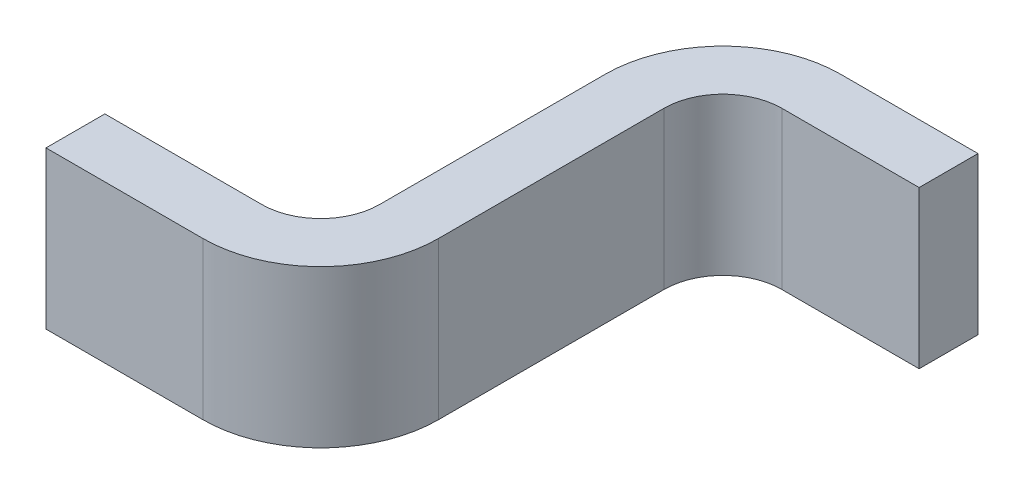
ISO-10303-21;
HEADER;
FILE_DESCRIPTION(('STEP AP214'),'2;1');
FILE_NAME('part.step','',(''),(''),'','','');
FILE_SCHEMA(('AUTOMOTIVE_DESIGN { 1 0 10303 214 1 1 1 1 }'));
ENDSEC;
DATA;
#1=APPLICATION_CONTEXT('core data for automotive mechanical design processes');
#2=APPLICATION_PROTOCOL_DEFINITION('international standard','automotive_design',2000,#1);
#3=PRODUCT_CONTEXT('',#1,'mechanical');
#4=PRODUCT('Part','Part','',(#3));
#5=PRODUCT_RELATED_PRODUCT_CATEGORY('part','',(#4));
#6=PRODUCT_DEFINITION_FORMATION('','',#4);
#7=PRODUCT_DEFINITION_CONTEXT('part definition',#1,'design');
#8=PRODUCT_DEFINITION('design','',#6,#7);
#9=PRODUCT_DEFINITION_SHAPE('','',#8);
#10=(LENGTH_UNIT() NAMED_UNIT(*) SI_UNIT(.MILLI.,.METRE.));
#11=(NAMED_UNIT(*) PLANE_ANGLE_UNIT() SI_UNIT($,.RADIAN.));
#12=(NAMED_UNIT(*) SI_UNIT($,.STERADIAN.) SOLID_ANGLE_UNIT());
#13=UNCERTAINTY_MEASURE_WITH_UNIT(LENGTH_MEASURE(1.E-05),#10,'distance_accuracy_value','');
#14=(GEOMETRIC_REPRESENTATION_CONTEXT(3) GLOBAL_UNCERTAINTY_ASSIGNED_CONTEXT((#13)) GLOBAL_UNIT_ASSIGNED_CONTEXT((#10,
#11,#12)) REPRESENTATION_CONTEXT('',''));
#15=CARTESIAN_POINT('',(0.,0.,0.));
#16=DIRECTION('',(0.,0.,1.));
#17=DIRECTION('',(1.,0.,0.));
#18=AXIS2_PLACEMENT_3D('',#15,#16,#17);
#19=CARTESIAN_POINT('',(3.15,1.47,0.));
#20=DIRECTION('',(0.,1.,0.));
#21=DIRECTION('',(1.,0.,0.));
#22=AXIS2_PLACEMENT_3D('',#19,#20,#21);
#23=PLANE('',#22);
#24=DIRECTION('',(-1.,0.,0.));
#25=VECTOR('',#24,1.);
#26=CARTESIAN_POINT('',(-2.475,1.47,0.));
#27=LINE('',#26,#25);
#28=CARTESIAN_POINT('',(3.4,1.47,0.));
#29=VERTEX_POINT('',#28);
#30=CARTESIAN_POINT('',(3.05,1.47,0.));
#31=VERTEX_POINT('',#30);
#32=EDGE_CURVE('E11',#29,#31,#27,.T.);
#33=ORIENTED_EDGE('',*,*,#32,.T.);
#34=CARTESIAN_POINT('',(3.05,1.47,0.3));
#35=DIRECTION('',(0.,-1.,0.));
#36=DIRECTION('',(0.,0.,-1.));
#37=AXIS2_PLACEMENT_3D('',#34,#35,#36);
#38=CIRCLE('',#37,0.3);
#39=CARTESIAN_POINT('',(2.75,1.47,0.3));
#40=VERTEX_POINT('',#39);
#41=EDGE_CURVE('E182',#40,#31,#38,.T.);
#42=ORIENTED_EDGE('',*,*,#41,.F.);
#43=DIRECTION('',(0.,0.,-1.));
#44=VECTOR('',#43,1.);
#45=CARTESIAN_POINT('',(2.75,1.47,1.175));
#46=LINE('',#45,#44);
#47=CARTESIAN_POINT('',(2.75,1.47,0.875));
#48=VERTEX_POINT('',#47);
#49=EDGE_CURVE('E237',#48,#40,#46,.T.);
#50=ORIENTED_EDGE('',*,*,#49,.F.);
#51=CARTESIAN_POINT('',(2.6,1.47,0.875));
#52=DIRECTION('',(0.,-1.,0.));
#53=DIRECTION('',(0.,0.,-1.));
#54=AXIS2_PLACEMENT_3D('',#51,#52,#53);
#55=CIRCLE('',#54,0.15);
#56=CARTESIAN_POINT('',(2.6,1.47,1.025));
#57=VERTEX_POINT('',#56);
#58=EDGE_CURVE('E232',#48,#57,#55,.T.);
#59=ORIENTED_EDGE('',*,*,#58,.T.);
#60=DIRECTION('',(-1.,0.,0.));
#61=VECTOR('',#60,1.);
#62=CARTESIAN_POINT('',(0.,1.47,1.025));
#63=LINE('',#62,#61);
#64=CARTESIAN_POINT('',(2.2,1.47,1.025));
#65=VERTEX_POINT('',#64);
#66=EDGE_CURVE('E191',#57,#65,#63,.T.);
#67=ORIENTED_EDGE('',*,*,#66,.T.);
#68=DIRECTION('',(0.,0.,-1.));
#69=VECTOR('',#68,1.);
#70=CARTESIAN_POINT('',(2.2,1.47,1.1));
#71=LINE('',#70,#69);
#72=CARTESIAN_POINT('',(2.2,1.47,1.175));
#73=VERTEX_POINT('',#72);
#74=EDGE_CURVE('E190',#73,#65,#71,.T.);
#75=ORIENTED_EDGE('',*,*,#74,.F.);
#76=DIRECTION('',(-1.,0.,0.));
#77=VECTOR('',#76,1.);
#78=CARTESIAN_POINT('',(-2.475,1.47,1.175));
#79=LINE('',#78,#77);
#80=CARTESIAN_POINT('',(2.6,1.47,1.175));
#81=VERTEX_POINT('',#80);
#82=EDGE_CURVE('E79',#81,#73,#79,.T.);
#83=ORIENTED_EDGE('',*,*,#82,.F.);
#84=CARTESIAN_POINT('',(2.6,1.47,0.875));
#85=DIRECTION('',(0.,-1.,0.));
#86=DIRECTION('',(0.,0.,-1.));
#87=AXIS2_PLACEMENT_3D('',#84,#85,#86);
#88=CIRCLE('',#87,0.3);
#89=CARTESIAN_POINT('',(2.9,1.47,0.875));
#90=VERTEX_POINT('',#89);
#91=EDGE_CURVE('E65',#90,#81,#88,.T.);
#92=ORIENTED_EDGE('',*,*,#91,.F.);
#93=DIRECTION('',(0.,0.,1.));
#94=VECTOR('',#93,1.);
#95=CARTESIAN_POINT('',(2.9,1.47,1.175));
#96=LINE('',#95,#94);
#97=CARTESIAN_POINT('',(2.9,1.47,0.3));
#98=VERTEX_POINT('',#97);
#99=EDGE_CURVE('E161',#98,#90,#96,.T.);
#100=ORIENTED_EDGE('',*,*,#99,.F.);
#101=CARTESIAN_POINT('',(3.05,1.47,0.3));
#102=DIRECTION('',(0.,-1.,0.));
#103=DIRECTION('',(0.,0.,-1.));
#104=AXIS2_PLACEMENT_3D('',#101,#102,#103);
#105=CIRCLE('',#104,0.15);
#106=CARTESIAN_POINT('',(3.05,1.47,0.15));
#107=VERTEX_POINT('',#106);
#108=EDGE_CURVE('E151',#98,#107,#105,.T.);
#109=ORIENTED_EDGE('',*,*,#108,.T.);
#110=DIRECTION('',(-1.,0.,0.));
#111=VECTOR('',#110,1.);
#112=CARTESIAN_POINT('',(0.,1.47,0.15));
#113=LINE('',#112,#111);
#114=CARTESIAN_POINT('',(3.4,1.47,0.15));
#115=VERTEX_POINT('',#114);
#116=EDGE_CURVE('E20',#115,#107,#113,.T.);
#117=ORIENTED_EDGE('',*,*,#116,.F.);
#118=DIRECTION('',(0.,0.,1.));
#119=VECTOR('',#118,1.);
#120=CARTESIAN_POINT('',(3.4,1.47,0.));
#121=LINE('',#120,#119);
#122=EDGE_CURVE('E26',#29,#115,#121,.T.);
#123=ORIENTED_EDGE('',*,*,#122,.F.);
#124=EDGE_LOOP('',(#33,#42,#50,#59,#67,#75,#83,#92,#100,#109,#117,#123));
#125=FACE_BOUND('',#124,.T.);
#126=ADVANCED_FACE('F16',(#125),#23,.T.);
#127=CARTESIAN_POINT('',(-2.475,1.27,0.));
#128=DIRECTION('',(0.,0.,1.));
#129=DIRECTION('',(1.,0.,0.));
#130=AXIS2_PLACEMENT_3D('',#127,#128,#129);
#131=PLANE('',#130);
#132=ORIENTED_EDGE('',*,*,#32,.F.);
#133=DIRECTION('',(0.,1.,0.));
#134=VECTOR('',#133,1.);
#135=CARTESIAN_POINT('',(3.4,1.27,0.));
#136=LINE('',#135,#134);
#137=CARTESIAN_POINT('',(3.4,1.07,0.));
#138=VERTEX_POINT('',#137);
#139=EDGE_CURVE('E223',#138,#29,#136,.T.);
#140=ORIENTED_EDGE('',*,*,#139,.F.);
#141=DIRECTION('',(1.,0.,0.));
#142=VECTOR('',#141,1.);
#143=CARTESIAN_POINT('',(2.825,1.07,0.));
#144=LINE('',#143,#142);
#145=CARTESIAN_POINT('',(3.05,1.07,0.));
#146=VERTEX_POINT('',#145);
#147=EDGE_CURVE('E197',#146,#138,#144,.T.);
#148=ORIENTED_EDGE('',*,*,#147,.F.);
#149=DIRECTION('',(0.,-1.,0.));
#150=VECTOR('',#149,1.);
#151=CARTESIAN_POINT('',(3.05,1.27,0.));
#152=LINE('',#151,#150);
#153=EDGE_CURVE('E179',#31,#146,#152,.T.);
#154=ORIENTED_EDGE('',*,*,#153,.F.);
#155=EDGE_LOOP('',(#132,#140,#148,#154));
#156=FACE_BOUND('',#155,.T.);
#157=ADVANCED_FACE('F286',(#156),#131,.F.);
#158=CARTESIAN_POINT('',(3.4,1.27,0.));
#159=DIRECTION('',(1.,0.,0.));
#160=DIRECTION('',(0.,1.,0.));
#161=AXIS2_PLACEMENT_3D('',#158,#159,#160);
#162=PLANE('',#161);
#163=ORIENTED_EDGE('',*,*,#139,.T.);
#164=ORIENTED_EDGE('',*,*,#122,.T.);
#165=DIRECTION('',(0.,1.,0.));
#166=VECTOR('',#165,1.);
#167=CARTESIAN_POINT('',(3.4,0.,0.15));
#168=LINE('',#167,#166);
#169=CARTESIAN_POINT('',(3.4,1.07,0.15));
#170=VERTEX_POINT('',#169);
#171=EDGE_CURVE('E201',#170,#115,#168,.T.);
#172=ORIENTED_EDGE('',*,*,#171,.F.);
#173=DIRECTION('',(0.,0.,1.));
#174=VECTOR('',#173,1.);
#175=CARTESIAN_POINT('',(3.4,1.07,1.175));
#176=LINE('',#175,#174);
#177=EDGE_CURVE('E205',#138,#170,#176,.T.);
#178=ORIENTED_EDGE('',*,*,#177,.F.);
#179=EDGE_LOOP('',(#163,#164,#172,#178));
#180=FACE_BOUND('',#179,.T.);
#181=ADVANCED_FACE('F287',(#180),#162,.T.);
#182=CARTESIAN_POINT('',(0.,0.,0.15));
#183=DIRECTION('',(0.,0.,1.));
#184=DIRECTION('',(1.,0.,0.));
#185=AXIS2_PLACEMENT_3D('',#182,#183,#184);
#186=PLANE('',#185);
#187=ORIENTED_EDGE('',*,*,#171,.T.);
#188=ORIENTED_EDGE('',*,*,#116,.T.);
#189=DIRECTION('',(0.,-1.,0.));
#190=VECTOR('',#189,1.);
#191=CARTESIAN_POINT('',(3.05,0.635,0.15));
#192=LINE('',#191,#190);
#193=CARTESIAN_POINT('',(3.05,1.07,0.15));
#194=VERTEX_POINT('',#193);
#195=EDGE_CURVE('E158',#107,#194,#192,.T.);
#196=ORIENTED_EDGE('',*,*,#195,.T.);
#197=DIRECTION('',(-1.,0.,0.));
#198=VECTOR('',#197,1.);
#199=CARTESIAN_POINT('',(2.825,1.07,0.15));
#200=LINE('',#199,#198);
#201=EDGE_CURVE('E185',#170,#194,#200,.T.);
#202=ORIENTED_EDGE('',*,*,#201,.F.);
#203=EDGE_LOOP('',(#187,#188,#196,#202));
#204=FACE_BOUND('',#203,.T.);
#205=ADVANCED_FACE('F290',(#204),#186,.T.);
#206=CARTESIAN_POINT('',(3.05,0.635,0.3));
#207=DIRECTION('',(0.,-1.,0.));
#208=DIRECTION('',(0.,0.,-1.));
#209=AXIS2_PLACEMENT_3D('',#206,#207,#208);
#210=CYLINDRICAL_SURFACE('',#209,0.15);
#211=ORIENTED_EDGE('',*,*,#108,.F.);
#212=DIRECTION('',(0.,1.,0.));
#213=VECTOR('',#212,1.);
#214=CARTESIAN_POINT('',(2.9,1.27,0.3));
#215=LINE('',#214,#213);
#216=CARTESIAN_POINT('',(2.9,1.07,0.3));
#217=VERTEX_POINT('',#216);
#218=EDGE_CURVE('E156',#217,#98,#215,.T.);
#219=ORIENTED_EDGE('',*,*,#218,.F.);
#220=CARTESIAN_POINT('',(3.05,1.07,0.3));
#221=DIRECTION('',(0.,1.,0.));
#222=DIRECTION('',(0.,0.,-1.));
#223=AXIS2_PLACEMENT_3D('',#220,#221,#222);
#224=CIRCLE('',#223,0.15);
#225=EDGE_CURVE('E183',#194,#217,#224,.T.);
#226=ORIENTED_EDGE('',*,*,#225,.F.);
#227=ORIENTED_EDGE('',*,*,#195,.F.);
#228=EDGE_LOOP('',(#211,#219,#226,#227));
#229=FACE_BOUND('',#228,.T.);
#230=ADVANCED_FACE('F153',(#229),#210,.F.);
#231=CARTESIAN_POINT('',(2.9,1.27,1.175));
#232=DIRECTION('',(1.,0.,0.));
#233=DIRECTION('',(0.,1.,0.));
#234=AXIS2_PLACEMENT_3D('',#231,#232,#233);
#235=PLANE('',#234);
#236=DIRECTION('',(0.,1.,0.));
#237=VECTOR('',#236,1.);
#238=CARTESIAN_POINT('',(2.9,1.27,0.875));
#239=LINE('',#238,#237);
#240=CARTESIAN_POINT('',(2.9,1.07,0.875));
#241=VERTEX_POINT('',#240);
#242=EDGE_CURVE('E176',#241,#90,#239,.T.);
#243=ORIENTED_EDGE('',*,*,#242,.F.);
#244=DIRECTION('',(0.,0.,1.));
#245=VECTOR('',#244,1.);
#246=CARTESIAN_POINT('',(2.9,1.07,1.175));
#247=LINE('',#246,#245);
#248=EDGE_CURVE('E168',#217,#241,#247,.T.);
#249=ORIENTED_EDGE('',*,*,#248,.F.);
#250=ORIENTED_EDGE('',*,*,#218,.T.);
#251=ORIENTED_EDGE('',*,*,#99,.T.);
#252=EDGE_LOOP('',(#243,#249,#250,#251));
#253=FACE_BOUND('',#252,.T.);
#254=ADVANCED_FACE('F166',(#253),#235,.T.);
#255=CARTESIAN_POINT('',(2.6,1.27,0.875));
#256=DIRECTION('',(0.,-1.,0.));
#257=DIRECTION('',(0.,0.,-1.));
#258=AXIS2_PLACEMENT_3D('',#255,#256,#257);
#259=CYLINDRICAL_SURFACE('',#258,0.3);
#260=DIRECTION('',(0.,1.,0.));
#261=VECTOR('',#260,1.);
#262=CARTESIAN_POINT('',(2.6,1.27,1.175));
#263=LINE('',#262,#261);
#264=CARTESIAN_POINT('',(2.6,1.07,1.175));
#265=VERTEX_POINT('',#264);
#266=EDGE_CURVE('E227',#265,#81,#263,.T.);
#267=ORIENTED_EDGE('',*,*,#266,.F.);
#268=CARTESIAN_POINT('',(2.6,1.07,0.875));
#269=DIRECTION('',(0.,-1.,0.));
#270=DIRECTION('',(0.,0.,-1.));
#271=AXIS2_PLACEMENT_3D('',#268,#269,#270);
#272=CIRCLE('',#271,0.3);
#273=EDGE_CURVE('E243',#241,#265,#272,.T.);
#274=ORIENTED_EDGE('',*,*,#273,.F.);
#275=ORIENTED_EDGE('',*,*,#242,.T.);
#276=ORIENTED_EDGE('',*,*,#91,.T.);
#277=EDGE_LOOP('',(#267,#274,#275,#276));
#278=FACE_BOUND('',#277,.T.);
#279=ADVANCED_FACE('F293',(#278),#259,.T.);
#280=CARTESIAN_POINT('',(-2.475,1.27,1.175));
#281=DIRECTION('',(0.,0.,1.));
#282=DIRECTION('',(1.,0.,0.));
#283=AXIS2_PLACEMENT_3D('',#280,#281,#282);
#284=PLANE('',#283);
#285=DIRECTION('',(0.,1.,0.));
#286=VECTOR('',#285,1.);
#287=CARTESIAN_POINT('',(2.2,1.27,1.175));
#288=LINE('',#287,#286);
#289=CARTESIAN_POINT('',(2.2,1.07,1.175));
#290=VERTEX_POINT('',#289);
#291=EDGE_CURVE('E187',#290,#73,#288,.T.);
#292=ORIENTED_EDGE('',*,*,#291,.F.);
#293=DIRECTION('',(-1.,0.,0.));
#294=VECTOR('',#293,1.);
#295=CARTESIAN_POINT('',(2.825,1.07,1.175));
#296=LINE('',#295,#294);
#297=EDGE_CURVE('E214',#265,#290,#296,.T.);
#298=ORIENTED_EDGE('',*,*,#297,.F.);
#299=ORIENTED_EDGE('',*,*,#266,.T.);
#300=ORIENTED_EDGE('',*,*,#82,.T.);
#301=EDGE_LOOP('',(#292,#298,#299,#300));
#302=FACE_BOUND('',#301,.T.);
#303=ADVANCED_FACE('F294',(#302),#284,.T.);
#304=CARTESIAN_POINT('',(2.2,1.27,1.1));
#305=DIRECTION('',(-1.,0.,0.));
#306=DIRECTION('',(0.,0.,1.));
#307=AXIS2_PLACEMENT_3D('',#304,#305,#306);
#308=PLANE('',#307);
#309=ORIENTED_EDGE('',*,*,#291,.T.);
#310=ORIENTED_EDGE('',*,*,#74,.T.);
#311=DIRECTION('',(0.,-1.,0.));
#312=VECTOR('',#311,1.);
#313=CARTESIAN_POINT('',(2.2,0.,1.025));
#314=LINE('',#313,#312);
#315=CARTESIAN_POINT('',(2.2,1.07,1.025));
#316=VERTEX_POINT('',#315);
#317=EDGE_CURVE('E258',#65,#316,#314,.T.);
#318=ORIENTED_EDGE('',*,*,#317,.T.);
#319=DIRECTION('',(0.,0.,-1.));
#320=VECTOR('',#319,1.);
#321=CARTESIAN_POINT('',(2.2,1.07,1.175));
#322=LINE('',#321,#320);
#323=EDGE_CURVE('E209',#290,#316,#322,.T.);
#324=ORIENTED_EDGE('',*,*,#323,.F.);
#325=EDGE_LOOP('',(#309,#310,#318,#324));
#326=FACE_BOUND('',#325,.T.);
#327=ADVANCED_FACE('F297',(#326),#308,.T.);
#328=CARTESIAN_POINT('',(0.,0.,1.025));
#329=DIRECTION('',(0.,0.,1.));
#330=DIRECTION('',(1.,0.,0.));
#331=AXIS2_PLACEMENT_3D('',#328,#329,#330);
#332=PLANE('',#331);
#333=DIRECTION('',(1.,0.,0.));
#334=VECTOR('',#333,1.);
#335=CARTESIAN_POINT('',(2.825,1.07,1.025));
#336=LINE('',#335,#334);
#337=CARTESIAN_POINT('',(2.6,1.07,1.025));
#338=VERTEX_POINT('',#337);
#339=EDGE_CURVE('E213',#316,#338,#336,.T.);
#340=ORIENTED_EDGE('',*,*,#339,.F.);
#341=ORIENTED_EDGE('',*,*,#317,.F.);
#342=ORIENTED_EDGE('',*,*,#66,.F.);
#343=DIRECTION('',(0.,-1.,0.));
#344=VECTOR('',#343,1.);
#345=CARTESIAN_POINT('',(2.6,0.635,1.025));
#346=LINE('',#345,#344);
#347=EDGE_CURVE('E236',#57,#338,#346,.T.);
#348=ORIENTED_EDGE('',*,*,#347,.T.);
#349=EDGE_LOOP('',(#340,#341,#342,#348));
#350=FACE_BOUND('',#349,.T.);
#351=ADVANCED_FACE('F303',(#350),#332,.F.);
#352=CARTESIAN_POINT('',(2.6,0.635,0.875));
#353=DIRECTION('',(0.,-1.,0.));
#354=DIRECTION('',(0.,0.,-1.));
#355=AXIS2_PLACEMENT_3D('',#352,#353,#354);
#356=CYLINDRICAL_SURFACE('',#355,0.15);
#357=ORIENTED_EDGE('',*,*,#58,.F.);
#358=DIRECTION('',(0.,1.,0.));
#359=VECTOR('',#358,1.);
#360=CARTESIAN_POINT('',(2.75,1.27,0.875));
#361=LINE('',#360,#359);
#362=CARTESIAN_POINT('',(2.75,1.07,0.875));
#363=VERTEX_POINT('',#362);
#364=EDGE_CURVE('E181',#363,#48,#361,.T.);
#365=ORIENTED_EDGE('',*,*,#364,.F.);
#366=CARTESIAN_POINT('',(2.6,1.07,0.875));
#367=DIRECTION('',(0.,1.,0.));
#368=DIRECTION('',(0.,0.,-1.));
#369=AXIS2_PLACEMENT_3D('',#366,#367,#368);
#370=CIRCLE('',#369,0.15);
#371=EDGE_CURVE('E215',#338,#363,#370,.T.);
#372=ORIENTED_EDGE('',*,*,#371,.F.);
#373=ORIENTED_EDGE('',*,*,#347,.F.);
#374=EDGE_LOOP('',(#357,#365,#372,#373));
#375=FACE_BOUND('',#374,.T.);
#376=ADVANCED_FACE('F306',(#375),#356,.F.);
#377=CARTESIAN_POINT('',(2.75,1.27,1.175));
#378=DIRECTION('',(-1.,0.,0.));
#379=DIRECTION('',(0.,0.,1.));
#380=AXIS2_PLACEMENT_3D('',#377,#378,#379);
#381=PLANE('',#380);
#382=ORIENTED_EDGE('',*,*,#364,.T.);
#383=ORIENTED_EDGE('',*,*,#49,.T.);
#384=DIRECTION('',(0.,1.,0.));
#385=VECTOR('',#384,1.);
#386=CARTESIAN_POINT('',(2.75,1.27,0.3));
#387=LINE('',#386,#385);
#388=CARTESIAN_POINT('',(2.75,1.07,0.3));
#389=VERTEX_POINT('',#388);
#390=EDGE_CURVE('E219',#389,#40,#387,.T.);
#391=ORIENTED_EDGE('',*,*,#390,.F.);
#392=DIRECTION('',(0.,0.,-1.));
#393=VECTOR('',#392,1.);
#394=CARTESIAN_POINT('',(2.75,1.07,1.175));
#395=LINE('',#394,#393);
#396=EDGE_CURVE('E198',#363,#389,#395,.T.);
#397=ORIENTED_EDGE('',*,*,#396,.F.);
#398=EDGE_LOOP('',(#382,#383,#391,#397));
#399=FACE_BOUND('',#398,.T.);
#400=ADVANCED_FACE('F18',(#399),#381,.T.);
#401=CARTESIAN_POINT('',(3.05,1.27,0.3));
#402=DIRECTION('',(0.,-1.,0.));
#403=DIRECTION('',(0.,0.,-1.));
#404=AXIS2_PLACEMENT_3D('',#401,#402,#403);
#405=CYLINDRICAL_SURFACE('',#404,0.3);
#406=ORIENTED_EDGE('',*,*,#390,.T.);
#407=ORIENTED_EDGE('',*,*,#41,.T.);
#408=ORIENTED_EDGE('',*,*,#153,.T.);
#409=CARTESIAN_POINT('',(3.05,1.07,0.3));
#410=DIRECTION('',(0.,-1.,0.));
#411=DIRECTION('',(0.,0.,-1.));
#412=AXIS2_PLACEMENT_3D('',#409,#410,#411);
#413=CIRCLE('',#412,0.3);
#414=EDGE_CURVE('E193',#389,#146,#413,.T.);
#415=ORIENTED_EDGE('',*,*,#414,.F.);
#416=EDGE_LOOP('',(#406,#407,#408,#415));
#417=FACE_BOUND('',#416,.T.);
#418=ADVANCED_FACE('F311',(#417),#405,.T.);
#419=CARTESIAN_POINT('',(2.825,1.07,1.175));
#420=DIRECTION('',(0.,-1.,0.));
#421=DIRECTION('',(0.,0.,-1.));
#422=AXIS2_PLACEMENT_3D('',#419,#420,#421);
#423=PLANE('',#422);
#424=ORIENTED_EDGE('',*,*,#396,.T.);
#425=ORIENTED_EDGE('',*,*,#414,.T.);
#426=ORIENTED_EDGE('',*,*,#147,.T.);
#427=ORIENTED_EDGE('',*,*,#177,.T.);
#428=ORIENTED_EDGE('',*,*,#201,.T.);
#429=ORIENTED_EDGE('',*,*,#225,.T.);
#430=ORIENTED_EDGE('',*,*,#248,.T.);
#431=ORIENTED_EDGE('',*,*,#273,.T.);
#432=ORIENTED_EDGE('',*,*,#297,.T.);
#433=ORIENTED_EDGE('',*,*,#323,.T.);
#434=ORIENTED_EDGE('',*,*,#339,.T.);
#435=ORIENTED_EDGE('',*,*,#371,.T.);
#436=EDGE_LOOP('',(#424,#425,#426,#427,#428,#429,#430,#431,#432,#433,#434,#435));
#437=FACE_BOUND('',#436,.T.);
#438=ADVANCED_FACE('F283',(#437),#423,.T.);
#439=CLOSED_SHELL('',(#126,#157,#181,#205,#230,#254,#279,#303,#327,#351,#376,#400,#418,#438));
#440=MANIFOLD_SOLID_BREP('B1',#439);
#441=ADVANCED_BREP_SHAPE_REPRESENTATION('',(#18,#440),#14);
#442=SHAPE_DEFINITION_REPRESENTATION(#9,#441);
ENDSEC;
END-ISO-10303-21;
